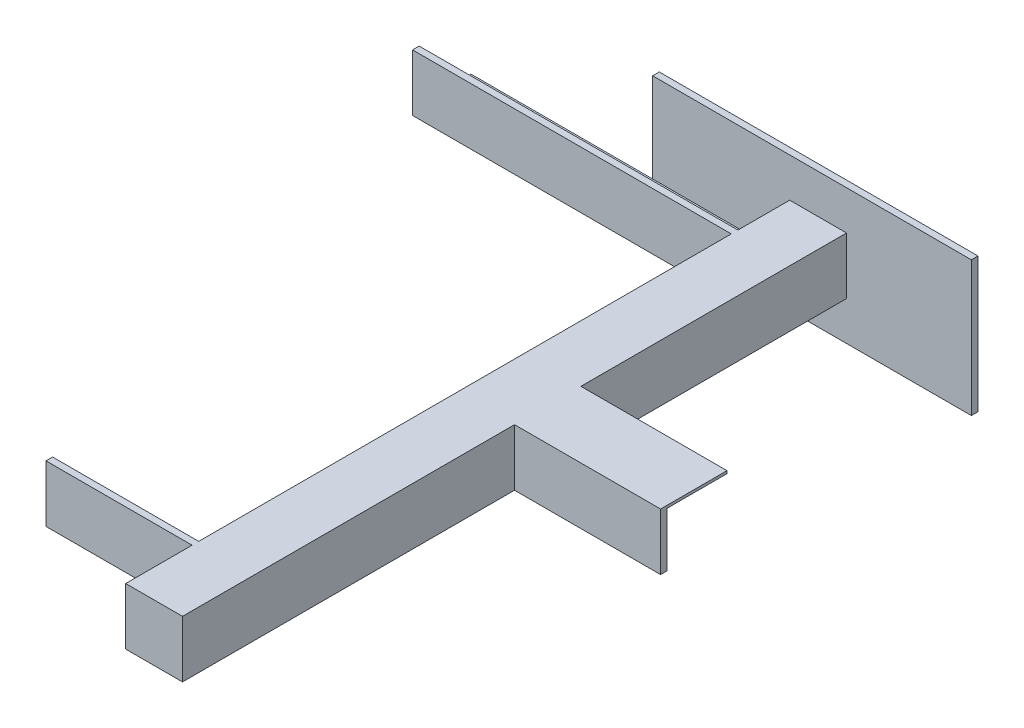
ISO-10303-21;
HEADER;
FILE_DESCRIPTION(('STEP AP214'),'2;1');
FILE_NAME('part.step','',(''),(''),'','','');
FILE_SCHEMA(('AUTOMOTIVE_DESIGN { 1 0 10303 214 1 1 1 1 }'));
ENDSEC;
DATA;
#1=APPLICATION_CONTEXT('core data for automotive mechanical design processes');
#2=APPLICATION_PROTOCOL_DEFINITION('international standard','automotive_design',2000,#1);
#3=PRODUCT_CONTEXT('',#1,'mechanical');
#4=PRODUCT('Part','Part','',(#3));
#5=PRODUCT_RELATED_PRODUCT_CATEGORY('part','',(#4));
#6=PRODUCT_DEFINITION_FORMATION('','',#4);
#7=PRODUCT_DEFINITION_CONTEXT('part definition',#1,'design');
#8=PRODUCT_DEFINITION('design','',#6,#7);
#9=PRODUCT_DEFINITION_SHAPE('','',#8);
#10=(LENGTH_UNIT() NAMED_UNIT(*) SI_UNIT(.MILLI.,.METRE.));
#11=(NAMED_UNIT(*) PLANE_ANGLE_UNIT() SI_UNIT($,.RADIAN.));
#12=(NAMED_UNIT(*) SI_UNIT($,.STERADIAN.) SOLID_ANGLE_UNIT());
#13=UNCERTAINTY_MEASURE_WITH_UNIT(LENGTH_MEASURE(1.E-05),#10,'distance_accuracy_value','');
#14=(GEOMETRIC_REPRESENTATION_CONTEXT(3) GLOBAL_UNCERTAINTY_ASSIGNED_CONTEXT((#13)) GLOBAL_UNIT_ASSIGNED_CONTEXT((#10,
#11,#12)) REPRESENTATION_CONTEXT('',''));
#15=CARTESIAN_POINT('',(0.,0.,0.));
#16=DIRECTION('',(0.,0.,1.));
#17=DIRECTION('',(1.,0.,0.));
#18=AXIS2_PLACEMENT_3D('',#15,#16,#17);
#19=CARTESIAN_POINT('',(-22847.3519939785,-1651.24743269941,40717.6001960681));
#20=DIRECTION('',(1.,0.,0.));
#21=DIRECTION('',(0.,0.,-1.));
#22=AXIS2_PLACEMENT_3D('',#19,#20,#21);
#23=PLANE('',#22);
#24=DIRECTION('',(0.,-1.,0.));
#25=VECTOR('',#24,1.);
#26=CARTESIAN_POINT('',(-22847.3519939785,0.,40256.6001960681));
#27=LINE('',#26,#25);
#28=CARTESIAN_POINT('',(-22847.3519939785,-1651.24743269941,40256.6001960681));
#29=VERTEX_POINT('',#28);
#30=CARTESIAN_POINT('',(-22847.3519939785,-1689.03828481264,40256.6001960681));
#31=VERTEX_POINT('',#30);
#32=EDGE_CURVE('E264',#29,#31,#27,.T.);
#33=ORIENTED_EDGE('',*,*,#32,.F.);
#34=DIRECTION('',(0.,0.,-1.));
#35=VECTOR('',#34,1.);
#36=CARTESIAN_POINT('',(-22847.3519939785,-1651.24743269941,40717.6001960681));
#37=LINE('',#36,#35);
#38=CARTESIAN_POINT('',(-22847.3519939785,-1651.24743269941,40217.6001960681));
#39=VERTEX_POINT('',#38);
#40=EDGE_CURVE('E380',#29,#39,#37,.T.);
#41=ORIENTED_EDGE('',*,*,#40,.T.);
#42=DIRECTION('',(0.,-1.,0.));
#43=VECTOR('',#42,1.);
#44=CARTESIAN_POINT('',(-22847.3519939785,-1651.24743269941,40217.6001960681));
#45=LINE('',#44,#43);
#46=CARTESIAN_POINT('',(-22847.3519939785,-1689.03828481264,40217.6001960681));
#47=VERTEX_POINT('',#46);
#48=EDGE_CURVE('E369',#39,#47,#45,.T.);
#49=ORIENTED_EDGE('',*,*,#48,.T.);
#50=DIRECTION('',(0.,0.,-1.));
#51=VECTOR('',#50,1.);
#52=CARTESIAN_POINT('',(-22847.3519939785,-1689.03828481264,0.));
#53=LINE('',#52,#51);
#54=EDGE_CURVE('E267',#31,#47,#53,.T.);
#55=ORIENTED_EDGE('',*,*,#54,.F.);
#56=EDGE_LOOP('',(#33,#41,#49,#55));
#57=FACE_BOUND('',#56,.T.);
#58=ADVANCED_FACE('F41',(#57),#23,.F.);
#59=CARTESIAN_POINT('',(-22847.3519939785,-1651.24743269941,40662.6001960679));
#60=VERTEX_POINT('',#59);
#61=CARTESIAN_POINT('',(-22847.3519939785,-1651.24743269941,40261.6001960681));
#62=VERTEX_POINT('',#61);
#63=EDGE_CURVE('E392',#60,#62,#37,.T.);
#64=ORIENTED_EDGE('',*,*,#63,.T.);
#65=DIRECTION('',(0.,-1.,0.));
#66=VECTOR('',#65,1.);
#67=CARTESIAN_POINT('',(-22847.3519939785,0.,40261.6001960681));
#68=LINE('',#67,#66);
#69=CARTESIAN_POINT('',(-22847.3519939785,-1694.03828481264,40261.6001960681));
#70=VERTEX_POINT('',#69);
#71=EDGE_CURVE('E270',#62,#70,#68,.T.);
#72=ORIENTED_EDGE('',*,*,#71,.T.);
#73=DIRECTION('',(0.,0.,-1.));
#74=VECTOR('',#73,1.);
#75=CARTESIAN_POINT('',(-22847.3519939785,-1694.03828481264,40717.6001960681));
#76=LINE('',#75,#74);
#77=CARTESIAN_POINT('',(-22847.3519939785,-1694.03828481264,40624.8093439547));
#78=VERTEX_POINT('',#77);
#79=EDGE_CURVE('E49',#78,#70,#76,.T.);
#80=ORIENTED_EDGE('',*,*,#79,.F.);
#81=DIRECTION('',(0.,-1.,0.));
#82=VECTOR('',#81,1.);
#83=CARTESIAN_POINT('',(-22847.3519939785,0.,40624.8093439547));
#84=LINE('',#83,#82);
#85=CARTESIAN_POINT('',(-22847.3519939785,-1689.03828481264,40624.8093439547));
#86=VERTEX_POINT('',#85);
#87=EDGE_CURVE('E306',#86,#78,#84,.T.);
#88=ORIENTED_EDGE('',*,*,#87,.F.);
#89=DIRECTION('',(0.,0.,-1.));
#90=VECTOR('',#89,1.);
#91=CARTESIAN_POINT('',(-22847.3519939785,-1689.03828481288,9.92414348135686E-12));
#92=LINE('',#91,#90);
#93=CARTESIAN_POINT('',(-22847.3519939785,-1689.03828481264,40662.600196068));
#94=VERTEX_POINT('',#93);
#95=EDGE_CURVE('E56',#94,#86,#92,.T.);
#96=ORIENTED_EDGE('',*,*,#95,.F.);
#97=DIRECTION('',(0.,-1.,3.19633610581926E-12));
#98=VECTOR('',#97,1.);
#99=CARTESIAN_POINT('',(-22847.3519939785,1.29971337163168E-07,40662.6001960626));
#100=LINE('',#99,#98);
#101=EDGE_CURVE('E61',#60,#94,#100,.T.);
#102=ORIENTED_EDGE('',*,*,#101,.F.);
#103=EDGE_LOOP('',(#64,#72,#80,#88,#96,#102));
#104=FACE_BOUND('',#103,.T.);
#105=ADVANCED_FACE('F456',(#104),#23,.F.);
#106=CARTESIAN_POINT('',(-22804.5611418652,-1651.24743269941,40717.6001960681));
#107=DIRECTION('',(-1.,0.,0.));
#108=DIRECTION('',(0.,0.,1.));
#109=AXIS2_PLACEMENT_3D('',#106,#107,#108);
#110=PLANE('',#109);
#111=DIRECTION('',(0.,1.,0.));
#112=VECTOR('',#111,1.);
#113=CARTESIAN_POINT('',(-22804.5611418652,0.,40417.6001960681));
#114=LINE('',#113,#112);
#115=CARTESIAN_POINT('',(-22804.5611418652,-1653.23137160843,40417.6001960681));
#116=VERTEX_POINT('',#115);
#117=CARTESIAN_POINT('',(-22804.5611418652,-1651.24743269941,40417.6001960681));
#118=VERTEX_POINT('',#117);
#119=EDGE_CURVE('E348',#116,#118,#114,.T.);
#120=ORIENTED_EDGE('',*,*,#119,.F.);
#121=DIRECTION('',(0.,0.,1.));
#122=VECTOR('',#121,1.);
#123=CARTESIAN_POINT('',(-22804.5611418652,-1653.23137160843,0.));
#124=LINE('',#123,#122);
#125=CARTESIAN_POINT('',(-22804.5611418652,-1653.23137160843,40462.6001960681));
#126=VERTEX_POINT('',#125);
#127=EDGE_CURVE('E346',#116,#126,#124,.T.);
#128=ORIENTED_EDGE('',*,*,#127,.T.);
#129=DIRECTION('',(0.,1.,0.));
#130=VECTOR('',#129,1.);
#131=CARTESIAN_POINT('',(-22804.5611418652,0.,40462.6001960681));
#132=LINE('',#131,#130);
#133=CARTESIAN_POINT('',(-22804.5611418652,-1694.03828481264,40462.6001960681));
#134=VERTEX_POINT('',#133);
#135=EDGE_CURVE('E326',#134,#126,#132,.T.);
#136=ORIENTED_EDGE('',*,*,#135,.F.);
#137=DIRECTION('',(0.,0.,-1.));
#138=VECTOR('',#137,1.);
#139=CARTESIAN_POINT('',(-22804.5611418652,-1694.03828481264,40717.6001960681));
#140=LINE('',#139,#138);
#141=CARTESIAN_POINT('',(-22804.5611418652,-1694.03828481264,40217.6001960681));
#142=VERTEX_POINT('',#141);
#143=EDGE_CURVE('E395',#134,#142,#140,.T.);
#144=ORIENTED_EDGE('',*,*,#143,.T.);
#145=DIRECTION('',(0.,1.,0.));
#146=VECTOR('',#145,1.);
#147=CARTESIAN_POINT('',(-22804.5611418652,-1651.24743269941,40217.6001960681));
#148=LINE('',#147,#146);
#149=CARTESIAN_POINT('',(-22804.5611418652,-1651.24743269941,40217.6001960681));
#150=VERTEX_POINT('',#149);
#151=EDGE_CURVE('E384',#142,#150,#148,.T.);
#152=ORIENTED_EDGE('',*,*,#151,.T.);
#153=DIRECTION('',(0.,0.,-1.));
#154=VECTOR('',#153,1.);
#155=CARTESIAN_POINT('',(-22804.5611418652,-1651.24743269941,40717.6001960681));
#156=LINE('',#155,#154);
#157=EDGE_CURVE('E391',#118,#150,#156,.T.);
#158=ORIENTED_EDGE('',*,*,#157,.F.);
#159=EDGE_LOOP('',(#120,#128,#136,#144,#152,#158));
#160=FACE_BOUND('',#159,.T.);
#161=ADVANCED_FACE('F404',(#160),#110,.F.);
#162=CARTESIAN_POINT('',(-22847.3519939785,-1651.24743269941,40717.6001960681));
#163=VERTEX_POINT('',#162);
#164=CARTESIAN_POINT('',(-22847.3519939785,-1651.24743269941,40667.600196068));
#165=VERTEX_POINT('',#164);
#166=EDGE_CURVE('E389',#163,#165,#37,.T.);
#167=ORIENTED_EDGE('',*,*,#166,.T.);
#168=DIRECTION('',(0.,-1.,0.));
#169=VECTOR('',#168,1.);
#170=CARTESIAN_POINT('',(-22847.3519939785,0.,40667.600196068));
#171=LINE('',#170,#169);
#172=CARTESIAN_POINT('',(-22847.3519939785,-1694.03828481264,40667.600196068));
#173=VERTEX_POINT('',#172);
#174=EDGE_CURVE('E292',#165,#173,#171,.T.);
#175=ORIENTED_EDGE('',*,*,#174,.T.);
#176=CARTESIAN_POINT('',(-22847.3519939785,-1694.03828481264,40717.6001960681));
#177=VERTEX_POINT('',#176);
#178=EDGE_CURVE('E11',#177,#173,#76,.T.);
#179=ORIENTED_EDGE('',*,*,#178,.F.);
#180=DIRECTION('',(0.,-1.,0.));
#181=VECTOR('',#180,1.);
#182=CARTESIAN_POINT('',(-22847.3519939785,-1651.24743269941,40717.6001960681));
#183=LINE('',#182,#181);
#184=EDGE_CURVE('E370',#163,#177,#183,.T.);
#185=ORIENTED_EDGE('',*,*,#184,.F.);
#186=EDGE_LOOP('',(#167,#175,#179,#185));
#187=FACE_BOUND('',#186,.T.);
#188=ADVANCED_FACE('F43',(#187),#23,.F.);
#189=CARTESIAN_POINT('',(-22804.5611418652,-1694.03828481264,40717.6001960681));
#190=DIRECTION('',(0.,1.,0.));
#191=DIRECTION('',(0.,0.,1.));
#192=AXIS2_PLACEMENT_3D('',#189,#190,#191);
#193=PLANE('',#192);
#194=DIRECTION('',(1.,0.,0.));
#195=VECTOR('',#194,1.);
#196=CARTESIAN_POINT('',(-22804.5611418652,-1694.03828481264,40217.6001960681));
#197=LINE('',#196,#195);
#198=CARTESIAN_POINT('',(-22950.5611418652,-1694.03828481264,40217.6001960681));
#199=VERTEX_POINT('',#198);
#200=EDGE_CURVE('E219',#199,#142,#197,.T.);
#201=ORIENTED_EDGE('',*,*,#200,.T.);
#202=ORIENTED_EDGE('',*,*,#143,.F.);
#203=DIRECTION('',(-1.,0.,0.));
#204=VECTOR('',#203,1.);
#205=CARTESIAN_POINT('',(-22694.5611418652,-1694.03828481264,40462.6001960681));
#206=LINE('',#205,#204);
#207=CARTESIAN_POINT('',(-22694.5611418652,-1694.03828481264,40462.6001960681));
#208=VERTEX_POINT('',#207);
#209=EDGE_CURVE('E366',#208,#134,#206,.T.);
#210=ORIENTED_EDGE('',*,*,#209,.F.);
#211=DIRECTION('',(0.,0.,-1.));
#212=VECTOR('',#211,1.);
#213=CARTESIAN_POINT('',(-22694.5611418652,-1694.03828481264,0.));
#214=LINE('',#213,#212);
#215=CARTESIAN_POINT('',(-22694.5611418652,-1694.03828481264,40467.6001960681));
#216=VERTEX_POINT('',#215);
#217=EDGE_CURVE('E327',#216,#208,#214,.T.);
#218=ORIENTED_EDGE('',*,*,#217,.F.);
#219=DIRECTION('',(-1.,0.,0.));
#220=VECTOR('',#219,1.);
#221=CARTESIAN_POINT('',(-22694.5611418652,-1694.03828481264,40467.6001960681));
#222=LINE('',#221,#220);
#223=CARTESIAN_POINT('',(-22804.5611418652,-1694.03828481264,40467.6001960681));
#224=VERTEX_POINT('',#223);
#225=EDGE_CURVE('E343',#216,#224,#222,.T.);
#226=ORIENTED_EDGE('',*,*,#225,.T.);
#227=CARTESIAN_POINT('',(-22804.5611418652,-1694.03828481264,40717.6001960681));
#228=VERTEX_POINT('',#227);
#229=EDGE_CURVE('E396',#228,#224,#140,.T.);
#230=ORIENTED_EDGE('',*,*,#229,.F.);
#231=DIRECTION('',(1.,0.,0.));
#232=VECTOR('',#231,1.);
#233=CARTESIAN_POINT('',(-22804.5611418652,-1694.03828481264,40717.6001960681));
#234=LINE('',#233,#232);
#235=EDGE_CURVE('E373',#177,#228,#234,.T.);
#236=ORIENTED_EDGE('',*,*,#235,.F.);
#237=ORIENTED_EDGE('',*,*,#178,.T.);
#238=DIRECTION('',(1.,0.,0.));
#239=VECTOR('',#238,1.);
#240=CARTESIAN_POINT('',(-22957.3519939785,-1694.03828481264,40667.600196068));
#241=LINE('',#240,#239);
#242=CARTESIAN_POINT('',(-22957.3519939785,-1694.03828481264,40667.600196068));
#243=VERTEX_POINT('',#242);
#244=EDGE_CURVE('E315',#243,#173,#241,.T.);
#245=ORIENTED_EDGE('',*,*,#244,.F.);
#246=DIRECTION('',(0.,0.,1.));
#247=VECTOR('',#246,1.);
#248=CARTESIAN_POINT('',(-22957.3519939785,-1694.03828481264,0.));
#249=LINE('',#248,#247);
#250=CARTESIAN_POINT('',(-22957.3519939785,-1694.03828481264,40624.8093439547));
#251=VERTEX_POINT('',#250);
#252=EDGE_CURVE('E296',#251,#243,#249,.T.);
#253=ORIENTED_EDGE('',*,*,#252,.F.);
#254=DIRECTION('',(1.,0.,0.));
#255=VECTOR('',#254,1.);
#256=CARTESIAN_POINT('',(-22957.3519939785,-1694.03828481264,40624.8093439547));
#257=LINE('',#256,#255);
#258=EDGE_CURVE('E318',#251,#78,#257,.T.);
#259=ORIENTED_EDGE('',*,*,#258,.T.);
#260=ORIENTED_EDGE('',*,*,#79,.T.);
#261=DIRECTION('',(1.,0.,0.));
#262=VECTOR('',#261,1.);
#263=CARTESIAN_POINT('',(-22957.3519939785,-1694.03828481264,40261.6001960681));
#264=LINE('',#263,#262);
#265=CARTESIAN_POINT('',(-23087.3519939785,-1694.03828481264,40261.6001960681));
#266=VERTEX_POINT('',#265);
#267=EDGE_CURVE('E277',#266,#70,#264,.T.);
#268=ORIENTED_EDGE('',*,*,#267,.F.);
#269=DIRECTION('',(0.,0.,-1.));
#270=VECTOR('',#269,1.);
#271=CARTESIAN_POINT('',(-23087.3519939785,-1694.03828481264,0.));
#272=LINE('',#271,#270);
#273=CARTESIAN_POINT('',(-23087.3519939785,-1694.03828481264,40217.6001960681));
#274=VERTEX_POINT('',#273);
#275=EDGE_CURVE('E261',#266,#274,#272,.T.);
#276=ORIENTED_EDGE('',*,*,#275,.T.);
#277=DIRECTION('',(1.,0.,0.));
#278=VECTOR('',#277,1.);
#279=CARTESIAN_POINT('',(-22957.3519939785,-1694.03828481264,40217.6001960681));
#280=LINE('',#279,#278);
#281=EDGE_CURVE('E279',#274,#199,#280,.T.);
#282=ORIENTED_EDGE('',*,*,#281,.T.);
#283=EDGE_LOOP('',(#201,#202,#210,#218,#226,#230,#236,#237,#245,#253,#259,#260,#268,#276,#282));
#284=FACE_BOUND('',#283,.T.);
#285=ADVANCED_FACE('F407',(#284),#193,.F.);
#286=ORIENTED_EDGE('',*,*,#229,.T.);
#287=DIRECTION('',(0.,1.,0.));
#288=VECTOR('',#287,1.);
#289=CARTESIAN_POINT('',(-22804.5611418652,0.,40467.6001960681));
#290=LINE('',#289,#288);
#291=CARTESIAN_POINT('',(-22804.5611418652,-1651.24743269941,40467.6001960681));
#292=VERTEX_POINT('',#291);
#293=EDGE_CURVE('E331',#224,#292,#290,.T.);
#294=ORIENTED_EDGE('',*,*,#293,.T.);
#295=CARTESIAN_POINT('',(-22804.5611418652,-1651.24743269941,40717.6001960681));
#296=VERTEX_POINT('',#295);
#297=EDGE_CURVE('E393',#296,#292,#156,.T.);
#298=ORIENTED_EDGE('',*,*,#297,.F.);
#299=DIRECTION('',(0.,1.,0.));
#300=VECTOR('',#299,1.);
#301=CARTESIAN_POINT('',(-22804.5611418652,-1651.24743269941,40717.6001960681));
#302=LINE('',#301,#300);
#303=EDGE_CURVE('E376',#228,#296,#302,.T.);
#304=ORIENTED_EDGE('',*,*,#303,.F.);
#305=EDGE_LOOP('',(#286,#294,#298,#304));
#306=FACE_BOUND('',#305,.T.);
#307=ADVANCED_FACE('F468',(#306),#110,.F.);
#308=CARTESIAN_POINT('',(-22804.5611418652,-1651.24743269941,40717.6001960681));
#309=DIRECTION('',(0.,-1.,0.));
#310=DIRECTION('',(0.,0.,-1.));
#311=AXIS2_PLACEMENT_3D('',#308,#309,#310);
#312=PLANE('',#311);
#313=DIRECTION('',(-1.,0.,0.));
#314=VECTOR('',#313,1.);
#315=CARTESIAN_POINT('',(-22804.5611418652,-1651.24743269941,40217.6001960681));
#316=LINE('',#315,#314);
#317=EDGE_CURVE('E374',#150,#39,#316,.T.);
#318=ORIENTED_EDGE('',*,*,#317,.T.);
#319=ORIENTED_EDGE('',*,*,#40,.F.);
#320=DIRECTION('',(1.,0.,0.));
#321=VECTOR('',#320,1.);
#322=CARTESIAN_POINT('',(-22957.3519939785,-1651.24743269941,40256.6001960681));
#323=LINE('',#322,#321);
#324=CARTESIAN_POINT('',(-23087.3519939785,-1651.24743269941,40256.6001960681));
#325=VERTEX_POINT('',#324);
#326=EDGE_CURVE('E273',#325,#29,#323,.T.);
#327=ORIENTED_EDGE('',*,*,#326,.F.);
#328=DIRECTION('',(0.,0.,1.));
#329=VECTOR('',#328,1.);
#330=CARTESIAN_POINT('',(-23087.3519939785,-1651.24743269941,0.));
#331=LINE('',#330,#329);
#332=CARTESIAN_POINT('',(-23087.3519939785,-1651.24743269941,40261.6001960681));
#333=VERTEX_POINT('',#332);
#334=EDGE_CURVE('E244',#325,#333,#331,.T.);
#335=ORIENTED_EDGE('',*,*,#334,.T.);
#336=DIRECTION('',(1.,0.,0.));
#337=VECTOR('',#336,1.);
#338=CARTESIAN_POINT('',(-22957.3519939785,-1651.24743269941,40261.6001960681));
#339=LINE('',#338,#337);
#340=EDGE_CURVE('E275',#333,#62,#339,.T.);
#341=ORIENTED_EDGE('',*,*,#340,.T.);
#342=ORIENTED_EDGE('',*,*,#63,.F.);
#343=DIRECTION('',(1.,0.,0.));
#344=VECTOR('',#343,1.);
#345=CARTESIAN_POINT('',(-22957.3519939785,-1651.24743269941,40662.6001960679));
#346=LINE('',#345,#344);
#347=CARTESIAN_POINT('',(-22957.3519939785,-1651.24743269941,40662.6001960679));
#348=VERTEX_POINT('',#347);
#349=EDGE_CURVE('E303',#348,#60,#346,.T.);
#350=ORIENTED_EDGE('',*,*,#349,.F.);
#351=DIRECTION('',(0.,0.,-1.));
#352=VECTOR('',#351,1.);
#353=CARTESIAN_POINT('',(-22957.3519939785,-1651.24743269941,0.));
#354=LINE('',#353,#352);
#355=CARTESIAN_POINT('',(-22957.3519939785,-1651.24743269941,40667.600196068));
#356=VERTEX_POINT('',#355);
#357=EDGE_CURVE('E301',#356,#348,#354,.T.);
#358=ORIENTED_EDGE('',*,*,#357,.F.);
#359=DIRECTION('',(1.,0.,0.));
#360=VECTOR('',#359,1.);
#361=CARTESIAN_POINT('',(-22957.3519939785,-1651.24743269941,40667.600196068));
#362=LINE('',#361,#360);
#363=EDGE_CURVE('E312',#356,#165,#362,.T.);
#364=ORIENTED_EDGE('',*,*,#363,.T.);
#365=ORIENTED_EDGE('',*,*,#166,.F.);
#366=DIRECTION('',(-1.,0.,0.));
#367=VECTOR('',#366,1.);
#368=CARTESIAN_POINT('',(-22804.5611418652,-1651.24743269941,40717.6001960681));
#369=LINE('',#368,#367);
#370=EDGE_CURVE('E378',#296,#163,#369,.T.);
#371=ORIENTED_EDGE('',*,*,#370,.F.);
#372=ORIENTED_EDGE('',*,*,#297,.T.);
#373=DIRECTION('',(-1.,0.,0.));
#374=VECTOR('',#373,1.);
#375=CARTESIAN_POINT('',(-22694.5611418652,-1651.24743269941,40467.6001960681));
#376=LINE('',#375,#374);
#377=CARTESIAN_POINT('',(-22694.5611418652,-1651.24743269941,40467.6001960681));
#378=VERTEX_POINT('',#377);
#379=EDGE_CURVE('E354',#378,#292,#376,.T.);
#380=ORIENTED_EDGE('',*,*,#379,.F.);
#381=DIRECTION('',(0.,0.,1.));
#382=VECTOR('',#381,1.);
#383=CARTESIAN_POINT('',(-22694.5611418652,-1651.24743269941,0.));
#384=LINE('',#383,#382);
#385=CARTESIAN_POINT('',(-22694.5611418652,-1651.24743269941,40417.6001960681));
#386=VERTEX_POINT('',#385);
#387=EDGE_CURVE('E338',#386,#378,#384,.T.);
#388=ORIENTED_EDGE('',*,*,#387,.F.);
#389=DIRECTION('',(-1.,0.,0.));
#390=VECTOR('',#389,1.);
#391=CARTESIAN_POINT('',(-22694.5611418652,-1651.24743269941,40417.6001960681));
#392=LINE('',#391,#390);
#393=EDGE_CURVE('E357',#386,#118,#392,.T.);
#394=ORIENTED_EDGE('',*,*,#393,.T.);
#395=ORIENTED_EDGE('',*,*,#157,.T.);
#396=EDGE_LOOP('',(#318,#319,#327,#335,#341,#342,#350,#358,#364,#365,#371,#372,#380,#388,#394,#395));
#397=FACE_BOUND('',#396,.T.);
#398=ADVANCED_FACE('F477',(#397),#312,.F.);
#399=CARTESIAN_POINT('',(0.,0.,40717.6001960681));
#400=DIRECTION('',(0.,0.,-1.));
#401=DIRECTION('',(-1.,0.,0.));
#402=AXIS2_PLACEMENT_3D('',#399,#400,#401);
#403=PLANE('',#402);
#404=ORIENTED_EDGE('',*,*,#184,.T.);
#405=ORIENTED_EDGE('',*,*,#235,.T.);
#406=ORIENTED_EDGE('',*,*,#303,.T.);
#407=ORIENTED_EDGE('',*,*,#370,.T.);
#408=EDGE_LOOP('',(#404,#405,#406,#407));
#409=FACE_BOUND('',#408,.T.);
#410=ADVANCED_FACE('F485',(#409),#403,.F.);
#411=CARTESIAN_POINT('',(-22694.5611418652,0.,40462.6001960681));
#412=DIRECTION('',(0.,0.,1.));
#413=DIRECTION('',(1.,0.,0.));
#414=AXIS2_PLACEMENT_3D('',#411,#412,#413);
#415=PLANE('',#414);
#416=ORIENTED_EDGE('',*,*,#135,.T.);
#417=DIRECTION('',(-1.,0.,0.));
#418=VECTOR('',#417,1.);
#419=CARTESIAN_POINT('',(-22694.5611418652,-1653.23137160843,40462.6001960681));
#420=LINE('',#419,#418);
#421=CARTESIAN_POINT('',(-22694.5611418652,-1653.23137160843,40462.6001960681));
#422=VERTEX_POINT('',#421);
#423=EDGE_CURVE('E363',#422,#126,#420,.T.);
#424=ORIENTED_EDGE('',*,*,#423,.F.);
#425=DIRECTION('',(0.,1.,0.));
#426=VECTOR('',#425,1.);
#427=CARTESIAN_POINT('',(-22694.5611418652,0.,40462.6001960681));
#428=LINE('',#427,#426);
#429=EDGE_CURVE('E330',#208,#422,#428,.T.);
#430=ORIENTED_EDGE('',*,*,#429,.F.);
#431=ORIENTED_EDGE('',*,*,#209,.T.);
#432=EDGE_LOOP('',(#416,#424,#430,#431));
#433=FACE_BOUND('',#432,.T.);
#434=ADVANCED_FACE('F507',(#433),#415,.F.);
#435=CARTESIAN_POINT('',(-22694.5611418652,-1653.23137160843,0.));
#436=DIRECTION('',(0.,-1.,0.));
#437=DIRECTION('',(0.,0.,-1.));
#438=AXIS2_PLACEMENT_3D('',#435,#436,#437);
#439=PLANE('',#438);
#440=ORIENTED_EDGE('',*,*,#127,.F.);
#441=DIRECTION('',(-1.,0.,0.));
#442=VECTOR('',#441,1.);
#443=CARTESIAN_POINT('',(-22694.5611418652,-1653.23137160843,40417.6001960681));
#444=LINE('',#443,#442);
#445=CARTESIAN_POINT('',(-22694.5611418652,-1653.23137160843,40417.6001960681));
#446=VERTEX_POINT('',#445);
#447=EDGE_CURVE('E360',#446,#116,#444,.T.);
#448=ORIENTED_EDGE('',*,*,#447,.F.);
#449=DIRECTION('',(0.,0.,1.));
#450=VECTOR('',#449,1.);
#451=CARTESIAN_POINT('',(-22694.5611418652,-1653.23137160843,0.));
#452=LINE('',#451,#450);
#453=EDGE_CURVE('E333',#446,#422,#452,.T.);
#454=ORIENTED_EDGE('',*,*,#453,.T.);
#455=ORIENTED_EDGE('',*,*,#423,.T.);
#456=EDGE_LOOP('',(#440,#448,#454,#455));
#457=FACE_BOUND('',#456,.T.);
#458=ADVANCED_FACE('F505',(#457),#439,.T.);
#459=CARTESIAN_POINT('',(-22694.5611418652,0.,40417.6001960681));
#460=DIRECTION('',(0.,0.,1.));
#461=DIRECTION('',(1.,0.,0.));
#462=AXIS2_PLACEMENT_3D('',#459,#460,#461);
#463=PLANE('',#462);
#464=ORIENTED_EDGE('',*,*,#119,.T.);
#465=ORIENTED_EDGE('',*,*,#393,.F.);
#466=DIRECTION('',(0.,1.,0.));
#467=VECTOR('',#466,1.);
#468=CARTESIAN_POINT('',(-22694.5611418652,0.,40417.6001960681));
#469=LINE('',#468,#467);
#470=EDGE_CURVE('E336',#446,#386,#469,.T.);
#471=ORIENTED_EDGE('',*,*,#470,.F.);
#472=ORIENTED_EDGE('',*,*,#447,.T.);
#473=EDGE_LOOP('',(#464,#465,#471,#472));
#474=FACE_BOUND('',#473,.T.);
#475=ADVANCED_FACE('F501',(#474),#463,.F.);
#476=CARTESIAN_POINT('',(-22694.5611418652,0.,40467.6001960681));
#477=DIRECTION('',(0.,0.,1.));
#478=DIRECTION('',(1.,0.,0.));
#479=AXIS2_PLACEMENT_3D('',#476,#477,#478);
#480=PLANE('',#479);
#481=ORIENTED_EDGE('',*,*,#293,.F.);
#482=ORIENTED_EDGE('',*,*,#225,.F.);
#483=DIRECTION('',(0.,1.,0.));
#484=VECTOR('',#483,1.);
#485=CARTESIAN_POINT('',(-22694.5611418652,0.,40467.6001960681));
#486=LINE('',#485,#484);
#487=EDGE_CURVE('E340',#216,#378,#486,.T.);
#488=ORIENTED_EDGE('',*,*,#487,.T.);
#489=ORIENTED_EDGE('',*,*,#379,.T.);
#490=EDGE_LOOP('',(#481,#482,#488,#489));
#491=FACE_BOUND('',#490,.T.);
#492=ADVANCED_FACE('F491',(#491),#480,.T.);
#493=CARTESIAN_POINT('',(-22694.5611418652,0.,0.));
#494=DIRECTION('',(1.,0.,0.));
#495=DIRECTION('',(0.,0.,-1.));
#496=AXIS2_PLACEMENT_3D('',#493,#494,#495);
#497=PLANE('',#496);
#498=ORIENTED_EDGE('',*,*,#217,.T.);
#499=ORIENTED_EDGE('',*,*,#429,.T.);
#500=ORIENTED_EDGE('',*,*,#453,.F.);
#501=ORIENTED_EDGE('',*,*,#470,.T.);
#502=ORIENTED_EDGE('',*,*,#387,.T.);
#503=ORIENTED_EDGE('',*,*,#487,.F.);
#504=EDGE_LOOP('',(#498,#499,#500,#501,#502,#503));
#505=FACE_BOUND('',#504,.T.);
#506=ADVANCED_FACE('F495',(#505),#497,.T.);
#507=CARTESIAN_POINT('',(-22957.3519939785,1.29971337163168E-07,40662.6001960626));
#508=DIRECTION('',(0.,3.19633610581926E-12,1.));
#509=DIRECTION('',(0.,-1.,3.19633610581926E-12));
#510=AXIS2_PLACEMENT_3D('',#507,#508,#509);
#511=PLANE('',#510);
#512=ORIENTED_EDGE('',*,*,#101,.T.);
#513=DIRECTION('',(1.,0.,0.));
#514=VECTOR('',#513,1.);
#515=CARTESIAN_POINT('',(-22957.3519939785,-1689.03828481264,40662.600196068));
#516=LINE('',#515,#514);
#517=CARTESIAN_POINT('',(-22957.3519939785,-1689.03828481264,40662.600196068));
#518=VERTEX_POINT('',#517);
#519=EDGE_CURVE('E324',#518,#94,#516,.T.);
#520=ORIENTED_EDGE('',*,*,#519,.F.);
#521=DIRECTION('',(0.,-1.,3.19633610581926E-12));
#522=VECTOR('',#521,1.);
#523=CARTESIAN_POINT('',(-22957.3519939785,1.29971337163168E-07,40662.6001960626));
#524=LINE('',#523,#522);
#525=EDGE_CURVE('E288',#348,#518,#524,.T.);
#526=ORIENTED_EDGE('',*,*,#525,.F.);
#527=ORIENTED_EDGE('',*,*,#349,.T.);
#528=EDGE_LOOP('',(#512,#520,#526,#527));
#529=FACE_BOUND('',#528,.T.);
#530=ADVANCED_FACE('F586',(#529),#511,.F.);
#531=CARTESIAN_POINT('',(-22957.3519939785,-1689.03828481288,9.92414348135686E-12));
#532=DIRECTION('',(0.,-1.,0.));
#533=DIRECTION('',(0.,0.,-1.));
#534=AXIS2_PLACEMENT_3D('',#531,#532,#533);
#535=PLANE('',#534);
#536=ORIENTED_EDGE('',*,*,#95,.T.);
#537=DIRECTION('',(1.,0.,0.));
#538=VECTOR('',#537,1.);
#539=CARTESIAN_POINT('',(-22957.3519939785,-1689.03828481264,40624.8093439547));
#540=LINE('',#539,#538);
#541=CARTESIAN_POINT('',(-22957.3519939785,-1689.03828481264,40624.8093439547));
#542=VERTEX_POINT('',#541);
#543=EDGE_CURVE('E321',#542,#86,#540,.T.);
#544=ORIENTED_EDGE('',*,*,#543,.F.);
#545=DIRECTION('',(0.,0.,-1.));
#546=VECTOR('',#545,1.);
#547=CARTESIAN_POINT('',(-22957.3519939785,-1689.03828481288,9.92414348135686E-12));
#548=LINE('',#547,#546);
#549=EDGE_CURVE('E291',#518,#542,#548,.T.);
#550=ORIENTED_EDGE('',*,*,#549,.F.);
#551=ORIENTED_EDGE('',*,*,#519,.T.);
#552=EDGE_LOOP('',(#536,#544,#550,#551));
#553=FACE_BOUND('',#552,.T.);
#554=ADVANCED_FACE('F604',(#553),#535,.F.);
#555=CARTESIAN_POINT('',(-22957.3519939785,0.,40624.8093439547));
#556=DIRECTION('',(0.,0.,1.));
#557=DIRECTION('',(1.,0.,0.));
#558=AXIS2_PLACEMENT_3D('',#555,#556,#557);
#559=PLANE('',#558);
#560=ORIENTED_EDGE('',*,*,#87,.T.);
#561=ORIENTED_EDGE('',*,*,#258,.F.);
#562=DIRECTION('',(0.,-1.,0.));
#563=VECTOR('',#562,1.);
#564=CARTESIAN_POINT('',(-22957.3519939785,0.,40624.8093439547));
#565=LINE('',#564,#563);
#566=EDGE_CURVE('E294',#542,#251,#565,.T.);
#567=ORIENTED_EDGE('',*,*,#566,.F.);
#568=ORIENTED_EDGE('',*,*,#543,.T.);
#569=EDGE_LOOP('',(#560,#561,#567,#568));
#570=FACE_BOUND('',#569,.T.);
#571=ADVANCED_FACE('F616',(#570),#559,.F.);
#572=CARTESIAN_POINT('',(-22957.3519939785,0.,40667.600196068));
#573=DIRECTION('',(0.,0.,1.));
#574=DIRECTION('',(1.,0.,0.));
#575=AXIS2_PLACEMENT_3D('',#572,#573,#574);
#576=PLANE('',#575);
#577=ORIENTED_EDGE('',*,*,#174,.F.);
#578=ORIENTED_EDGE('',*,*,#363,.F.);
#579=DIRECTION('',(0.,-1.,0.));
#580=VECTOR('',#579,1.);
#581=CARTESIAN_POINT('',(-22957.3519939785,0.,40667.600196068));
#582=LINE('',#581,#580);
#583=EDGE_CURVE('E298',#356,#243,#582,.T.);
#584=ORIENTED_EDGE('',*,*,#583,.T.);
#585=ORIENTED_EDGE('',*,*,#244,.T.);
#586=EDGE_LOOP('',(#577,#578,#584,#585));
#587=FACE_BOUND('',#586,.T.);
#588=ADVANCED_FACE('F481',(#587),#576,.T.);
#589=CARTESIAN_POINT('',(-22957.3519939785,0.,0.));
#590=DIRECTION('',(-1.,0.,0.));
#591=DIRECTION('',(0.,0.,1.));
#592=AXIS2_PLACEMENT_3D('',#589,#590,#591);
#593=PLANE('',#592);
#594=ORIENTED_EDGE('',*,*,#525,.T.);
#595=ORIENTED_EDGE('',*,*,#549,.T.);
#596=ORIENTED_EDGE('',*,*,#566,.T.);
#597=ORIENTED_EDGE('',*,*,#252,.T.);
#598=ORIENTED_EDGE('',*,*,#583,.F.);
#599=ORIENTED_EDGE('',*,*,#357,.T.);
#600=EDGE_LOOP('',(#594,#595,#596,#597,#598,#599));
#601=FACE_BOUND('',#600,.T.);
#602=ADVANCED_FACE('F639',(#601),#593,.T.);
#603=CARTESIAN_POINT('',(0.,0.,40217.6001960681));
#604=DIRECTION('',(0.,0.,1.));
#605=DIRECTION('',(1.,0.,0.));
#606=AXIS2_PLACEMENT_3D('',#603,#604,#605);
#607=PLANE('',#606);
#608=ORIENTED_EDGE('',*,*,#200,.F.);
#609=DIRECTION('',(0.,-1.,0.));
#610=VECTOR('',#609,1.);
#611=CARTESIAN_POINT('',(-22950.5611418652,-1621.73851770681,40217.6001960681));
#612=LINE('',#611,#610);
#613=CARTESIAN_POINT('',(-22950.5611418652,-1723.33851770681,40217.6001960681));
#614=VERTEX_POINT('',#613);
#615=EDGE_CURVE('E213',#199,#614,#612,.T.);
#616=ORIENTED_EDGE('',*,*,#615,.T.);
#617=DIRECTION('',(1.,0.,0.));
#618=VECTOR('',#617,1.);
#619=CARTESIAN_POINT('',(-22950.5611418652,-1723.33851770681,40217.6001960681));
#620=LINE('',#619,#618);
#621=CARTESIAN_POINT('',(-22710.5611418652,-1723.33851770681,40217.6001960681));
#622=VERTEX_POINT('',#621);
#623=EDGE_CURVE('E216',#614,#622,#620,.T.);
#624=ORIENTED_EDGE('',*,*,#623,.T.);
#625=DIRECTION('',(0.,1.,0.));
#626=VECTOR('',#625,1.);
#627=CARTESIAN_POINT('',(-22710.5611418652,-1621.73851770681,40217.6001960681));
#628=LINE('',#627,#626);
#629=CARTESIAN_POINT('',(-22710.5611418652,-1621.73851770681,40217.6001960681));
#630=VERTEX_POINT('',#629);
#631=EDGE_CURVE('E235',#622,#630,#628,.T.);
#632=ORIENTED_EDGE('',*,*,#631,.T.);
#633=DIRECTION('',(-1.,0.,0.));
#634=VECTOR('',#633,1.);
#635=CARTESIAN_POINT('',(-22950.5611418652,-1621.73851770681,40217.6001960681));
#636=LINE('',#635,#634);
#637=CARTESIAN_POINT('',(-22950.5611418652,-1621.73851770681,40217.6001960681));
#638=VERTEX_POINT('',#637);
#639=EDGE_CURVE('E425',#630,#638,#636,.T.);
#640=ORIENTED_EDGE('',*,*,#639,.T.);
#641=CARTESIAN_POINT('',(-22950.5611418652,-1689.03828481264,40217.6001960681));
#642=VERTEX_POINT('',#641);
#643=EDGE_CURVE('E223',#638,#642,#612,.T.);
#644=ORIENTED_EDGE('',*,*,#643,.T.);
#645=DIRECTION('',(1.,0.,0.));
#646=VECTOR('',#645,1.);
#647=CARTESIAN_POINT('',(-22957.3519939785,-1689.03828481264,40217.6001960681));
#648=LINE('',#647,#646);
#649=EDGE_CURVE('E282',#642,#47,#648,.T.);
#650=ORIENTED_EDGE('',*,*,#649,.T.);
#651=ORIENTED_EDGE('',*,*,#48,.F.);
#652=ORIENTED_EDGE('',*,*,#317,.F.);
#653=ORIENTED_EDGE('',*,*,#151,.F.);
#654=EDGE_LOOP('',(#608,#616,#624,#632,#640,#644,#650,#651,#652,#653));
#655=FACE_BOUND('',#654,.T.);
#656=ADVANCED_FACE('F215',(#655),#607,.T.);
#657=CARTESIAN_POINT('',(-22957.3519939785,0.,40256.6001960681));
#658=DIRECTION('',(0.,0.,1.));
#659=DIRECTION('',(1.,0.,0.));
#660=AXIS2_PLACEMENT_3D('',#657,#658,#659);
#661=PLANE('',#660);
#662=ORIENTED_EDGE('',*,*,#32,.T.);
#663=DIRECTION('',(1.,0.,0.));
#664=VECTOR('',#663,1.);
#665=CARTESIAN_POINT('',(-22957.3519939785,-1689.03828481264,40256.6001960681));
#666=LINE('',#665,#664);
#667=CARTESIAN_POINT('',(-23087.3519939785,-1689.03828481264,40256.6001960681));
#668=VERTEX_POINT('',#667);
#669=EDGE_CURVE('E286',#668,#31,#666,.T.);
#670=ORIENTED_EDGE('',*,*,#669,.F.);
#671=DIRECTION('',(0.,1.,0.));
#672=VECTOR('',#671,1.);
#673=CARTESIAN_POINT('',(-23087.3519939785,0.,40256.6001960681));
#674=LINE('',#673,#672);
#675=EDGE_CURVE('E252',#668,#325,#674,.T.);
#676=ORIENTED_EDGE('',*,*,#675,.T.);
#677=ORIENTED_EDGE('',*,*,#326,.T.);
#678=EDGE_LOOP('',(#662,#670,#676,#677));
#679=FACE_BOUND('',#678,.T.);
#680=ADVANCED_FACE('F670',(#679),#661,.F.);
#681=CARTESIAN_POINT('',(-22957.3519939785,-1689.03828481264,0.));
#682=DIRECTION('',(0.,-1.,0.));
#683=DIRECTION('',(0.,0.,-1.));
#684=AXIS2_PLACEMENT_3D('',#681,#682,#683);
#685=PLANE('',#684);
#686=ORIENTED_EDGE('',*,*,#54,.T.);
#687=ORIENTED_EDGE('',*,*,#649,.F.);
#688=CARTESIAN_POINT('',(-23087.3519939785,-1689.03828481264,40217.6001960681));
#689=VERTEX_POINT('',#688);
#690=EDGE_CURVE('E283',#689,#642,#648,.T.);
#691=ORIENTED_EDGE('',*,*,#690,.F.);
#692=DIRECTION('',(0.,0.,1.));
#693=VECTOR('',#692,1.);
#694=CARTESIAN_POINT('',(-23087.3519939785,-1689.03828481264,0.));
#695=LINE('',#694,#693);
#696=EDGE_CURVE('E255',#689,#668,#695,.T.);
#697=ORIENTED_EDGE('',*,*,#696,.T.);
#698=ORIENTED_EDGE('',*,*,#669,.T.);
#699=EDGE_LOOP('',(#686,#687,#691,#697,#698));
#700=FACE_BOUND('',#699,.T.);
#701=ADVANCED_FACE('F418',(#700),#685,.F.);
#702=CARTESIAN_POINT('',(-22957.3519939785,0.,40217.6001960681));
#703=DIRECTION('',(0.,0.,1.));
#704=DIRECTION('',(1.,0.,0.));
#705=AXIS2_PLACEMENT_3D('',#702,#703,#704);
#706=PLANE('',#705);
#707=ORIENTED_EDGE('',*,*,#690,.T.);
#708=EDGE_CURVE('E226',#642,#199,#612,.T.);
#709=ORIENTED_EDGE('',*,*,#708,.T.);
#710=ORIENTED_EDGE('',*,*,#281,.F.);
#711=DIRECTION('',(0.,1.,0.));
#712=VECTOR('',#711,1.);
#713=CARTESIAN_POINT('',(-23087.3519939785,0.,40217.6001960681));
#714=LINE('',#713,#712);
#715=EDGE_CURVE('E258',#274,#689,#714,.T.);
#716=ORIENTED_EDGE('',*,*,#715,.T.);
#717=EDGE_LOOP('',(#707,#709,#710,#716));
#718=FACE_BOUND('',#717,.T.);
#719=ADVANCED_FACE('F411',(#718),#706,.F.);
#720=CARTESIAN_POINT('',(-22957.3519939785,0.,40261.6001960681));
#721=DIRECTION('',(0.,0.,1.));
#722=DIRECTION('',(1.,0.,0.));
#723=AXIS2_PLACEMENT_3D('',#720,#721,#722);
#724=PLANE('',#723);
#725=ORIENTED_EDGE('',*,*,#71,.F.);
#726=ORIENTED_EDGE('',*,*,#340,.F.);
#727=DIRECTION('',(0.,1.,0.));
#728=VECTOR('',#727,1.);
#729=CARTESIAN_POINT('',(-23087.3519939785,0.,40261.6001960681));
#730=LINE('',#729,#728);
#731=EDGE_CURVE('E241',#266,#333,#730,.T.);
#732=ORIENTED_EDGE('',*,*,#731,.F.);
#733=ORIENTED_EDGE('',*,*,#267,.T.);
#734=EDGE_LOOP('',(#725,#726,#732,#733));
#735=FACE_BOUND('',#734,.T.);
#736=ADVANCED_FACE('F704',(#735),#724,.T.);
#737=CARTESIAN_POINT('',(-23087.3519939785,0.,0.));
#738=DIRECTION('',(1.,0.,0.));
#739=DIRECTION('',(0.,0.,-1.));
#740=AXIS2_PLACEMENT_3D('',#737,#738,#739);
#741=PLANE('',#740);
#742=ORIENTED_EDGE('',*,*,#731,.T.);
#743=ORIENTED_EDGE('',*,*,#334,.F.);
#744=ORIENTED_EDGE('',*,*,#675,.F.);
#745=ORIENTED_EDGE('',*,*,#696,.F.);
#746=ORIENTED_EDGE('',*,*,#715,.F.);
#747=ORIENTED_EDGE('',*,*,#275,.F.);
#748=EDGE_LOOP('',(#742,#743,#744,#745,#746,#747));
#749=FACE_BOUND('',#748,.T.);
#750=ADVANCED_FACE('F414',(#749),#741,.F.);
#751=CARTESIAN_POINT('',(-22950.5611418652,-1621.73851770681,40217.6001960681));
#752=DIRECTION('',(1.,0.,0.));
#753=DIRECTION('',(0.,0.,-1.));
#754=AXIS2_PLACEMENT_3D('',#751,#752,#753);
#755=PLANE('',#754);
#756=DIRECTION('',(0.,-1.,0.));
#757=VECTOR('',#756,1.);
#758=CARTESIAN_POINT('',(-22950.5611418652,-1621.73851770681,40212.6001960681));
#759=LINE('',#758,#757);
#760=CARTESIAN_POINT('',(-22950.5611418652,-1621.73851770681,40212.6001960681));
#761=VERTEX_POINT('',#760);
#762=CARTESIAN_POINT('',(-22950.5611418652,-1723.33851770681,40212.6001960681));
#763=VERTEX_POINT('',#762);
#764=EDGE_CURVE('E240',#761,#763,#759,.T.);
#765=ORIENTED_EDGE('',*,*,#764,.T.);
#766=DIRECTION('',(0.,0.,-1.));
#767=VECTOR('',#766,1.);
#768=CARTESIAN_POINT('',(-22950.5611418652,-1723.33851770681,40217.6001960681));
#769=LINE('',#768,#767);
#770=EDGE_CURVE('E230',#614,#763,#769,.T.);
#771=ORIENTED_EDGE('',*,*,#770,.F.);
#772=ORIENTED_EDGE('',*,*,#615,.F.);
#773=ORIENTED_EDGE('',*,*,#708,.F.);
#774=ORIENTED_EDGE('',*,*,#643,.F.);
#775=DIRECTION('',(0.,0.,-1.));
#776=VECTOR('',#775,1.);
#777=CARTESIAN_POINT('',(-22950.5611418652,-1621.73851770681,40217.6001960681));
#778=LINE('',#777,#776);
#779=EDGE_CURVE('E430',#638,#761,#778,.T.);
#780=ORIENTED_EDGE('',*,*,#779,.T.);
#781=EDGE_LOOP('',(#765,#771,#772,#773,#774,#780));
#782=FACE_BOUND('',#781,.T.);
#783=ADVANCED_FACE('F237',(#782),#755,.F.);
#784=CARTESIAN_POINT('',(-22950.5611418652,-1723.33851770681,40217.6001960681));
#785=DIRECTION('',(0.,1.,0.));
#786=DIRECTION('',(0.,0.,1.));
#787=AXIS2_PLACEMENT_3D('',#784,#785,#786);
#788=PLANE('',#787);
#789=DIRECTION('',(1.,0.,0.));
#790=VECTOR('',#789,1.);
#791=CARTESIAN_POINT('',(-22950.5611418652,-1723.33851770681,40212.6001960681));
#792=LINE('',#791,#790);
#793=CARTESIAN_POINT('',(-22710.5611418652,-1723.33851770681,40212.6001960681));
#794=VERTEX_POINT('',#793);
#795=EDGE_CURVE('E432',#763,#794,#792,.T.);
#796=ORIENTED_EDGE('',*,*,#795,.T.);
#797=DIRECTION('',(0.,0.,-1.));
#798=VECTOR('',#797,1.);
#799=CARTESIAN_POINT('',(-22710.5611418652,-1723.33851770681,40217.6001960681));
#800=LINE('',#799,#798);
#801=EDGE_CURVE('E233',#622,#794,#800,.T.);
#802=ORIENTED_EDGE('',*,*,#801,.F.);
#803=ORIENTED_EDGE('',*,*,#623,.F.);
#804=ORIENTED_EDGE('',*,*,#770,.T.);
#805=EDGE_LOOP('',(#796,#802,#803,#804));
#806=FACE_BOUND('',#805,.T.);
#807=ADVANCED_FACE('F229',(#806),#788,.F.);
#808=CARTESIAN_POINT('',(-22710.5611418652,-1621.73851770681,40217.6001960681));
#809=DIRECTION('',(-1.,0.,0.));
#810=DIRECTION('',(0.,0.,1.));
#811=AXIS2_PLACEMENT_3D('',#808,#809,#810);
#812=PLANE('',#811);
#813=DIRECTION('',(0.,1.,0.));
#814=VECTOR('',#813,1.);
#815=CARTESIAN_POINT('',(-22710.5611418652,-1621.73851770681,40212.6001960681));
#816=LINE('',#815,#814);
#817=CARTESIAN_POINT('',(-22710.5611418652,-1621.73851770681,40212.6001960681));
#818=VERTEX_POINT('',#817);
#819=EDGE_CURVE('E434',#794,#818,#816,.T.);
#820=ORIENTED_EDGE('',*,*,#819,.T.);
#821=DIRECTION('',(0.,0.,-1.));
#822=VECTOR('',#821,1.);
#823=CARTESIAN_POINT('',(-22710.5611418652,-1621.73851770681,40217.6001960681));
#824=LINE('',#823,#822);
#825=EDGE_CURVE('E246',#630,#818,#824,.T.);
#826=ORIENTED_EDGE('',*,*,#825,.F.);
#827=ORIENTED_EDGE('',*,*,#631,.F.);
#828=ORIENTED_EDGE('',*,*,#801,.T.);
#829=EDGE_LOOP('',(#820,#826,#827,#828));
#830=FACE_BOUND('',#829,.T.);
#831=ADVANCED_FACE('F446',(#830),#812,.F.);
#832=CARTESIAN_POINT('',(-22950.5611418652,-1621.73851770681,40217.6001960681));
#833=DIRECTION('',(0.,-1.,0.));
#834=DIRECTION('',(0.,0.,-1.));
#835=AXIS2_PLACEMENT_3D('',#832,#833,#834);
#836=PLANE('',#835);
#837=DIRECTION('',(-1.,0.,0.));
#838=VECTOR('',#837,1.);
#839=CARTESIAN_POINT('',(-22950.5611418652,-1621.73851770681,40212.6001960681));
#840=LINE('',#839,#838);
#841=EDGE_CURVE('E224',#818,#761,#840,.T.);
#842=ORIENTED_EDGE('',*,*,#841,.T.);
#843=ORIENTED_EDGE('',*,*,#779,.F.);
#844=ORIENTED_EDGE('',*,*,#639,.F.);
#845=ORIENTED_EDGE('',*,*,#825,.T.);
#846=EDGE_LOOP('',(#842,#843,#844,#845));
#847=FACE_BOUND('',#846,.T.);
#848=ADVANCED_FACE('F441',(#847),#836,.F.);
#849=CARTESIAN_POINT('',(0.,0.,40212.6001960681));
#850=DIRECTION('',(0.,0.,1.));
#851=DIRECTION('',(1.,0.,0.));
#852=AXIS2_PLACEMENT_3D('',#849,#850,#851);
#853=PLANE('',#852);
#854=ORIENTED_EDGE('',*,*,#764,.F.);
#855=ORIENTED_EDGE('',*,*,#841,.F.);
#856=ORIENTED_EDGE('',*,*,#819,.F.);
#857=ORIENTED_EDGE('',*,*,#795,.F.);
#858=EDGE_LOOP('',(#854,#855,#856,#857));
#859=FACE_BOUND('',#858,.T.);
#860=ADVANCED_FACE('F445',(#859),#853,.F.);
#861=CLOSED_SHELL('',(#58,#105,#161,#188,#285,#307,#398,#410,#434,#458,#475,#492,#506,#530,#554,
#571,#588,#602,#656,#680,#701,#719,#736,#750,#783,#807,#831,#848,#860));
#862=MANIFOLD_SOLID_BREP('B2',#861);
#863=ADVANCED_BREP_SHAPE_REPRESENTATION('',(#18,#862),#14);
#864=SHAPE_DEFINITION_REPRESENTATION(#9,#863);
ENDSEC;
END-ISO-10303-21;
